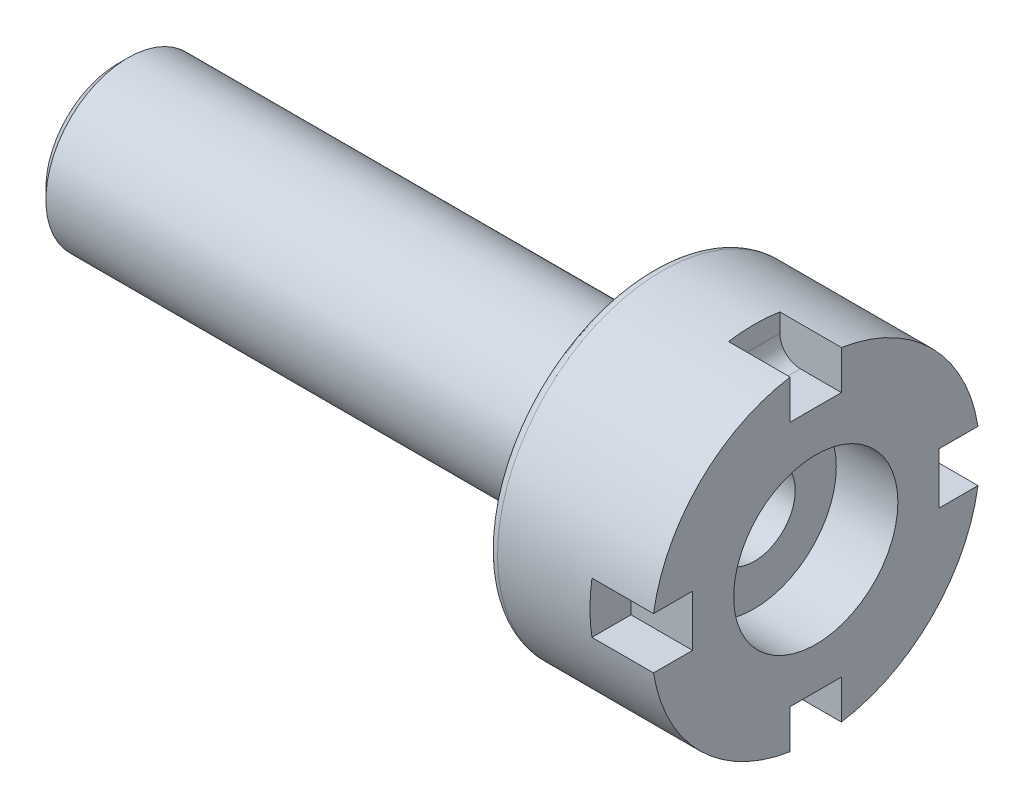
ISO-10303-21;
HEADER;
FILE_DESCRIPTION(('STEP AP214'),'2;1');
FILE_NAME('part.step','',(''),(''),'','','');
FILE_SCHEMA(('AUTOMOTIVE_DESIGN { 1 0 10303 214 1 1 1 1 }'));
ENDSEC;
DATA;
#1=APPLICATION_CONTEXT('core data for automotive mechanical design processes');
#2=APPLICATION_PROTOCOL_DEFINITION('international standard','automotive_design',2000,#1);
#3=PRODUCT_CONTEXT('',#1,'mechanical');
#4=PRODUCT('Part','Part','',(#3));
#5=PRODUCT_RELATED_PRODUCT_CATEGORY('part','',(#4));
#6=PRODUCT_DEFINITION_FORMATION('','',#4);
#7=PRODUCT_DEFINITION_CONTEXT('part definition',#1,'design');
#8=PRODUCT_DEFINITION('design','',#6,#7);
#9=PRODUCT_DEFINITION_SHAPE('','',#8);
#10=(LENGTH_UNIT() NAMED_UNIT(*) SI_UNIT(.MILLI.,.METRE.));
#11=(NAMED_UNIT(*) PLANE_ANGLE_UNIT() SI_UNIT($,.RADIAN.));
#12=(NAMED_UNIT(*) SI_UNIT($,.STERADIAN.) SOLID_ANGLE_UNIT());
#13=UNCERTAINTY_MEASURE_WITH_UNIT(LENGTH_MEASURE(1.E-05),#10,'distance_accuracy_value','');
#14=(GEOMETRIC_REPRESENTATION_CONTEXT(3) GLOBAL_UNCERTAINTY_ASSIGNED_CONTEXT((#13)) GLOBAL_UNIT_ASSIGNED_CONTEXT((#10,
#11,#12)) REPRESENTATION_CONTEXT('',''));
#15=CARTESIAN_POINT('',(0.,0.,0.));
#16=DIRECTION('',(0.,0.,1.));
#17=DIRECTION('',(1.,0.,0.));
#18=AXIS2_PLACEMENT_3D('',#15,#16,#17);
#19=CARTESIAN_POINT('',(-88.99,0.,0.));
#20=DIRECTION('',(-1.,0.,0.));
#21=DIRECTION('',(0.,0.,1.));
#22=AXIS2_PLACEMENT_3D('',#19,#20,#21);
#23=CYLINDRICAL_SURFACE('',#22,20.);
#24=CARTESIAN_POINT('',(-288.48571603173,0.,0.));
#25=DIRECTION('',(1.,0.,0.));
#26=DIRECTION('',(0.,0.,-1.));
#27=AXIS2_PLACEMENT_3D('',#24,#25,#26);
#28=CIRCLE('',#27,20.);
#29=CARTESIAN_POINT('',(-288.48571603173,0.,-20.));
#30=VERTEX_POINT('',#29);
#31=EDGE_CURVE('E11',#30,#30,#28,.F.);
#32=ORIENTED_EDGE('',*,*,#31,.T.);
#33=EDGE_LOOP('',(#32));
#34=FACE_BOUND('',#33,.T.);
#35=CARTESIAN_POINT('',(16.5142839682696,0.,0.));
#36=DIRECTION('',(1.,0.,0.));
#37=DIRECTION('',(0.,0.,-1.));
#38=AXIS2_PLACEMENT_3D('',#35,#36,#37);
#39=CIRCLE('',#38,20.);
#40=CARTESIAN_POINT('',(16.5142839682696,0.,-20.));
#41=VERTEX_POINT('',#40);
#42=EDGE_CURVE('E264',#41,#41,#39,.F.);
#43=ORIENTED_EDGE('',*,*,#42,.F.);
#44=EDGE_LOOP('',(#43));
#45=FACE_BOUND('',#44,.T.);
#46=ADVANCED_FACE('F47',(#34,#45),#23,.F.);
#47=CARTESIAN_POINT('',(-293.48571603173,40.,0.));
#48=DIRECTION('',(1.,0.,0.));
#49=DIRECTION('',(0.,0.,-1.));
#50=AXIS2_PLACEMENT_3D('',#47,#48,#49);
#51=PLANE('',#50);
#52=CARTESIAN_POINT('',(-293.48571603173,0.,0.));
#53=DIRECTION('',(1.,0.,0.));
#54=DIRECTION('',(0.,0.,-1.));
#55=AXIS2_PLACEMENT_3D('',#52,#53,#54);
#56=CIRCLE('',#55,34.9999999999999);
#57=CARTESIAN_POINT('',(-293.48571603173,0.,-34.9999999999999));
#58=VERTEX_POINT('',#57);
#59=EDGE_CURVE('E376',#58,#58,#56,.F.);
#60=ORIENTED_EDGE('',*,*,#59,.T.);
#61=EDGE_LOOP('',(#60));
#62=FACE_BOUND('',#61,.T.);
#63=CARTESIAN_POINT('',(-293.48571603173,0.,0.));
#64=DIRECTION('',(1.,0.,0.));
#65=DIRECTION('',(0.,0.,-1.));
#66=AXIS2_PLACEMENT_3D('',#63,#64,#65);
#67=CIRCLE('',#66,25.);
#68=CARTESIAN_POINT('',(-293.48571603173,0.,-25.));
#69=VERTEX_POINT('',#68);
#70=EDGE_CURVE('E372',#69,#69,#67,.T.);
#71=ORIENTED_EDGE('',*,*,#70,.T.);
#72=EDGE_LOOP('',(#71));
#73=FACE_BOUND('',#72,.T.);
#74=ADVANCED_FACE('F392',(#62,#73),#51,.F.);
#75=CARTESIAN_POINT('',(46.5142839682696,80.,0.));
#76=DIRECTION('',(-1.,0.,0.));
#77=DIRECTION('',(0.,0.,1.));
#78=AXIS2_PLACEMENT_3D('',#75,#76,#77);
#79=PLANE('',#78);
#80=CARTESIAN_POINT('',(46.5142839682696,0.,0.));
#81=DIRECTION('',(1.,0.,0.));
#82=DIRECTION('',(0.,0.,-1.));
#83=AXIS2_PLACEMENT_3D('',#80,#81,#82);
#84=CIRCLE('',#83,40.);
#85=CARTESIAN_POINT('',(46.5142839682696,0.,-40.));
#86=VERTEX_POINT('',#85);
#87=EDGE_CURVE('E265',#86,#86,#84,.T.);
#88=ORIENTED_EDGE('',*,*,#87,.F.);
#89=EDGE_LOOP('',(#88));
#90=FACE_BOUND('',#89,.T.);
#91=CARTESIAN_POINT('',(46.5142839682696,0.,0.));
#92=DIRECTION('',(-1.,0.,0.));
#93=DIRECTION('',(0.,0.,1.));
#94=AXIS2_PLACEMENT_3D('',#91,#92,#93);
#95=CIRCLE('',#94,80.);
#96=CARTESIAN_POINT('',(46.5142839682696,-12.4999999999992,-79.0174031463957));
#97=VERTEX_POINT('',#96);
#98=CARTESIAN_POINT('',(46.5142839682696,-79.0174031463955,-12.5));
#99=VERTEX_POINT('',#98);
#100=EDGE_CURVE('E297',#97,#99,#95,.T.);
#101=ORIENTED_EDGE('',*,*,#100,.F.);
#102=DIRECTION('',(0.,0.,-1.));
#103=VECTOR('',#102,1.);
#104=CARTESIAN_POINT('',(46.5142839682696,-12.4999999999991,-90.0000000000001));
#105=LINE('',#104,#103);
#106=CARTESIAN_POINT('',(46.5142839682696,-12.4999999999994,-60.0000000000001));
#107=VERTEX_POINT('',#106);
#108=EDGE_CURVE('E246',#107,#97,#105,.T.);
#109=ORIENTED_EDGE('',*,*,#108,.F.);
#110=DIRECTION('',(0.,-1.,0.));
#111=VECTOR('',#110,1.);
#112=CARTESIAN_POINT('',(46.5142839682696,12.5000000000006,-59.9999999999999));
#113=LINE('',#112,#111);
#114=CARTESIAN_POINT('',(46.5142839682696,12.5000000000006,-59.9999999999999));
#115=VERTEX_POINT('',#114);
#116=EDGE_CURVE('E239',#115,#107,#113,.T.);
#117=ORIENTED_EDGE('',*,*,#116,.F.);
#118=DIRECTION('',(0.,0.,1.));
#119=VECTOR('',#118,1.);
#120=CARTESIAN_POINT('',(46.5142839682696,12.5000000000009,-89.9999999999999));
#121=LINE('',#120,#119);
#122=CARTESIAN_POINT('',(46.5142839682696,12.5000000000008,-79.0174031463954));
#123=VERTEX_POINT('',#122);
#124=EDGE_CURVE('E249',#123,#115,#121,.T.);
#125=ORIENTED_EDGE('',*,*,#124,.F.);
#126=CARTESIAN_POINT('',(46.5142839682696,79.0174031463955,-12.5));
#127=VERTEX_POINT('',#126);
#128=EDGE_CURVE('E292',#127,#123,#95,.T.);
#129=ORIENTED_EDGE('',*,*,#128,.F.);
#130=DIRECTION('',(0.,1.,0.));
#131=VECTOR('',#130,1.);
#132=CARTESIAN_POINT('',(46.5142839682696,90.,-12.5));
#133=LINE('',#132,#131);
#134=CARTESIAN_POINT('',(46.5142839682696,60.,-12.5));
#135=VERTEX_POINT('',#134);
#136=EDGE_CURVE('E269',#135,#127,#133,.T.);
#137=ORIENTED_EDGE('',*,*,#136,.F.);
#138=DIRECTION('',(0.,0.,-1.));
#139=VECTOR('',#138,1.);
#140=CARTESIAN_POINT('',(46.5142839682696,60.,12.5));
#141=LINE('',#140,#139);
#142=CARTESIAN_POINT('',(46.5142839682696,60.,12.5));
#143=VERTEX_POINT('',#142);
#144=EDGE_CURVE('E276',#143,#135,#141,.T.);
#145=ORIENTED_EDGE('',*,*,#144,.F.);
#146=DIRECTION('',(0.,-1.,0.));
#147=VECTOR('',#146,1.);
#148=CARTESIAN_POINT('',(46.5142839682696,90.,12.5));
#149=LINE('',#148,#147);
#150=CARTESIAN_POINT('',(46.5142839682696,79.0174031463955,12.5));
#151=VERTEX_POINT('',#150);
#152=EDGE_CURVE('E280',#151,#143,#149,.T.);
#153=ORIENTED_EDGE('',*,*,#152,.F.);
#154=CARTESIAN_POINT('',(46.5142839682696,12.4999999999997,79.0174031463956));
#155=VERTEX_POINT('',#154);
#156=EDGE_CURVE('E298',#155,#151,#95,.T.);
#157=ORIENTED_EDGE('',*,*,#156,.F.);
#158=DIRECTION('',(0.,0.,1.));
#159=VECTOR('',#158,1.);
#160=CARTESIAN_POINT('',(46.5142839682696,12.4999999999997,90.));
#161=LINE('',#160,#159);
#162=CARTESIAN_POINT('',(46.5142839682696,12.4999999999998,60.));
#163=VERTEX_POINT('',#162);
#164=EDGE_CURVE('E209',#163,#155,#161,.T.);
#165=ORIENTED_EDGE('',*,*,#164,.F.);
#166=DIRECTION('',(0.,1.,0.));
#167=VECTOR('',#166,1.);
#168=CARTESIAN_POINT('',(46.5142839682696,-12.5000000000002,60.));
#169=LINE('',#168,#167);
#170=CARTESIAN_POINT('',(46.5142839682696,-12.5000000000002,60.));
#171=VERTEX_POINT('',#170);
#172=EDGE_CURVE('E214',#171,#163,#169,.T.);
#173=ORIENTED_EDGE('',*,*,#172,.F.);
#174=DIRECTION('',(0.,0.,-1.));
#175=VECTOR('',#174,1.);
#176=CARTESIAN_POINT('',(46.5142839682696,-12.5000000000003,90.));
#177=LINE('',#176,#175);
#178=CARTESIAN_POINT('',(46.5142839682696,-12.5000000000003,79.0174031463955));
#179=VERTEX_POINT('',#178);
#180=EDGE_CURVE('E223',#179,#171,#177,.T.);
#181=ORIENTED_EDGE('',*,*,#180,.F.);
#182=CARTESIAN_POINT('',(46.5142839682696,-79.0174031463955,12.5));
#183=VERTEX_POINT('',#182);
#184=EDGE_CURVE('E749',#183,#179,#95,.T.);
#185=ORIENTED_EDGE('',*,*,#184,.F.);
#186=DIRECTION('',(0.,-1.,0.));
#187=VECTOR('',#186,1.);
#188=CARTESIAN_POINT('',(46.5142839682696,-90.,12.5));
#189=LINE('',#188,#187);
#190=CARTESIAN_POINT('',(46.5142839682696,-60.,12.5));
#191=VERTEX_POINT('',#190);
#192=EDGE_CURVE('E199',#191,#183,#189,.T.);
#193=ORIENTED_EDGE('',*,*,#192,.F.);
#194=DIRECTION('',(0.,0.,1.));
#195=VECTOR('',#194,1.);
#196=CARTESIAN_POINT('',(46.5142839682696,-60.,-12.5));
#197=LINE('',#196,#195);
#198=CARTESIAN_POINT('',(46.5142839682696,-60.,-12.5));
#199=VERTEX_POINT('',#198);
#200=EDGE_CURVE('E205',#199,#191,#197,.T.);
#201=ORIENTED_EDGE('',*,*,#200,.F.);
#202=DIRECTION('',(0.,1.,0.));
#203=VECTOR('',#202,1.);
#204=CARTESIAN_POINT('',(46.5142839682696,-90.,-12.5));
#205=LINE('',#204,#203);
#206=EDGE_CURVE('E186',#99,#199,#205,.T.);
#207=ORIENTED_EDGE('',*,*,#206,.F.);
#208=EDGE_LOOP('',(#101,#109,#117,#125,#129,#137,#145,#153,#157,#165,#173,#181,#185,#193,#201,#207));
#209=FACE_BOUND('',#208,.T.);
#210=ADVANCED_FACE('F395',(#90,#209),#79,.F.);
#211=CARTESIAN_POINT('',(-88.99,0.,0.));
#212=DIRECTION('',(-1.,0.,0.));
#213=DIRECTION('',(0.,0.,1.));
#214=AXIS2_PLACEMENT_3D('',#211,#212,#213);
#215=CYLINDRICAL_SURFACE('',#214,80.);
#216=CARTESIAN_POINT('',(-28.4857160317304,0.,0.));
#217=DIRECTION('',(1.,0.,0.));
#218=DIRECTION('',(0.,0.,-1.));
#219=AXIS2_PLACEMENT_3D('',#216,#217,#218);
#220=CIRCLE('',#219,80.);
#221=CARTESIAN_POINT('',(-28.4857160317304,0.,-80.));
#222=VERTEX_POINT('',#221);
#223=EDGE_CURVE('E364',#222,#222,#220,.T.);
#224=ORIENTED_EDGE('',*,*,#223,.T.);
#225=EDGE_LOOP('',(#224));
#226=FACE_BOUND('',#225,.T.);
#227=CARTESIAN_POINT('',(16.5142839682696,0.,0.));
#228=DIRECTION('',(1.,0.,0.));
#229=DIRECTION('',(0.,0.,-1.));
#230=AXIS2_PLACEMENT_3D('',#227,#228,#229);
#231=CIRCLE('',#230,80.);
#232=CARTESIAN_POINT('',(16.5142839682696,-12.4999999999992,-79.0174031463957));
#233=VERTEX_POINT('',#232);
#234=CARTESIAN_POINT('',(16.5142839682696,12.5000000000008,-79.0174031463954));
#235=VERTEX_POINT('',#234);
#236=EDGE_CURVE('E345',#233,#235,#231,.T.);
#237=ORIENTED_EDGE('',*,*,#236,.F.);
#238=DIRECTION('',(-1.,0.,0.));
#239=VECTOR('',#238,1.);
#240=CARTESIAN_POINT('',(-88.99,-12.4999999999992,-79.0174031463957));
#241=LINE('',#240,#239);
#242=EDGE_CURVE('E352',#233,#97,#241,.F.);
#243=ORIENTED_EDGE('',*,*,#242,.T.);
#244=ORIENTED_EDGE('',*,*,#100,.T.);
#245=DIRECTION('',(-1.,0.,0.));
#246=VECTOR('',#245,1.);
#247=CARTESIAN_POINT('',(-88.99,-79.0174031463955,-12.5));
#248=LINE('',#247,#246);
#249=CARTESIAN_POINT('',(16.5142839682696,-79.0174031463955,-12.5));
#250=VERTEX_POINT('',#249);
#251=EDGE_CURVE('E327',#99,#250,#248,.T.);
#252=ORIENTED_EDGE('',*,*,#251,.T.);
#253=CARTESIAN_POINT('',(16.5142839682696,0.,0.));
#254=DIRECTION('',(1.,0.,0.));
#255=DIRECTION('',(0.,0.,-1.));
#256=AXIS2_PLACEMENT_3D('',#253,#254,#255);
#257=CIRCLE('',#256,80.);
#258=CARTESIAN_POINT('',(16.5142839682696,-79.0174031463955,12.5));
#259=VERTEX_POINT('',#258);
#260=EDGE_CURVE('E176',#259,#250,#257,.T.);
#261=ORIENTED_EDGE('',*,*,#260,.F.);
#262=DIRECTION('',(-1.,0.,0.));
#263=VECTOR('',#262,1.);
#264=CARTESIAN_POINT('',(-88.99,-79.0174031463955,12.5));
#265=LINE('',#264,#263);
#266=EDGE_CURVE('E330',#259,#183,#265,.F.);
#267=ORIENTED_EDGE('',*,*,#266,.T.);
#268=ORIENTED_EDGE('',*,*,#184,.T.);
#269=DIRECTION('',(-1.,0.,0.));
#270=VECTOR('',#269,1.);
#271=CARTESIAN_POINT('',(-88.99,-12.5000000000003,79.0174031463955));
#272=LINE('',#271,#270);
#273=CARTESIAN_POINT('',(16.5142839682696,-12.5000000000003,79.0174031463955));
#274=VERTEX_POINT('',#273);
#275=EDGE_CURVE('E337',#179,#274,#272,.T.);
#276=ORIENTED_EDGE('',*,*,#275,.T.);
#277=CARTESIAN_POINT('',(16.5142839682696,0.,0.));
#278=DIRECTION('',(1.,0.,0.));
#279=DIRECTION('',(0.,0.,-1.));
#280=AXIS2_PLACEMENT_3D('',#277,#278,#279);
#281=CIRCLE('',#280,80.);
#282=CARTESIAN_POINT('',(16.5142839682696,12.4999999999997,79.0174031463956));
#283=VERTEX_POINT('',#282);
#284=EDGE_CURVE('E334',#283,#274,#281,.T.);
#285=ORIENTED_EDGE('',*,*,#284,.F.);
#286=DIRECTION('',(-1.,0.,0.));
#287=VECTOR('',#286,1.);
#288=CARTESIAN_POINT('',(-88.99,12.4999999999997,79.0174031463956));
#289=LINE('',#288,#287);
#290=EDGE_CURVE('E341',#283,#155,#289,.F.);
#291=ORIENTED_EDGE('',*,*,#290,.T.);
#292=ORIENTED_EDGE('',*,*,#156,.T.);
#293=DIRECTION('',(-1.,0.,0.));
#294=VECTOR('',#293,1.);
#295=CARTESIAN_POINT('',(-88.99,79.0174031463955,12.5));
#296=LINE('',#295,#294);
#297=CARTESIAN_POINT('',(16.5142839682696,79.0174031463955,12.5));
#298=VERTEX_POINT('',#297);
#299=EDGE_CURVE('E301',#151,#298,#296,.T.);
#300=ORIENTED_EDGE('',*,*,#299,.T.);
#301=CARTESIAN_POINT('',(16.5142839682696,0.,0.));
#302=DIRECTION('',(1.,0.,0.));
#303=DIRECTION('',(0.,0.,-1.));
#304=AXIS2_PLACEMENT_3D('',#301,#302,#303);
#305=CIRCLE('',#304,80.);
#306=CARTESIAN_POINT('',(16.5142839682696,79.0174031463955,-12.5));
#307=VERTEX_POINT('',#306);
#308=EDGE_CURVE('E296',#307,#298,#305,.T.);
#309=ORIENTED_EDGE('',*,*,#308,.F.);
#310=DIRECTION('',(-1.,0.,0.));
#311=VECTOR('',#310,1.);
#312=CARTESIAN_POINT('',(-88.99,79.0174031463955,-12.5));
#313=LINE('',#312,#311);
#314=EDGE_CURVE('E305',#307,#127,#313,.F.);
#315=ORIENTED_EDGE('',*,*,#314,.T.);
#316=ORIENTED_EDGE('',*,*,#128,.T.);
#317=DIRECTION('',(-1.,0.,0.));
#318=VECTOR('',#317,1.);
#319=CARTESIAN_POINT('',(-88.99,12.5000000000008,-79.0174031463954));
#320=LINE('',#319,#318);
#321=EDGE_CURVE('E348',#123,#235,#320,.T.);
#322=ORIENTED_EDGE('',*,*,#321,.T.);
#323=EDGE_LOOP('',(#237,#243,#244,#252,#261,#267,#268,#276,#285,#291,#292,#300,#309,#315,#316,#322));
#324=FACE_BOUND('',#323,.T.);
#325=ADVANCED_FACE('F444',(#226,#324),#215,.T.);
#326=CARTESIAN_POINT('',(-33.4857160317304,80.,0.));
#327=DIRECTION('',(1.,0.,0.));
#328=DIRECTION('',(0.,0.,-1.));
#329=AXIS2_PLACEMENT_3D('',#326,#327,#328);
#330=PLANE('',#329);
#331=CARTESIAN_POINT('',(-33.4857160317304,0.,0.));
#332=DIRECTION('',(1.,0.,0.));
#333=DIRECTION('',(0.,0.,-1.));
#334=AXIS2_PLACEMENT_3D('',#331,#332,#333);
#335=CIRCLE('',#334,75.);
#336=CARTESIAN_POINT('',(-33.4857160317304,0.,-75.));
#337=VERTEX_POINT('',#336);
#338=EDGE_CURVE('E360',#337,#337,#335,.F.);
#339=ORIENTED_EDGE('',*,*,#338,.T.);
#340=EDGE_LOOP('',(#339));
#341=FACE_BOUND('',#340,.T.);
#342=CARTESIAN_POINT('',(-33.4857160317304,0.,0.));
#343=DIRECTION('',(1.,0.,0.));
#344=DIRECTION('',(0.,0.,-1.));
#345=AXIS2_PLACEMENT_3D('',#342,#343,#344);
#346=CIRCLE('',#345,45.);
#347=CARTESIAN_POINT('',(-33.4857160317304,0.,-45.));
#348=VERTEX_POINT('',#347);
#349=EDGE_CURVE('E356',#348,#348,#346,.T.);
#350=ORIENTED_EDGE('',*,*,#349,.T.);
#351=EDGE_LOOP('',(#350));
#352=FACE_BOUND('',#351,.T.);
#353=ADVANCED_FACE('F441',(#341,#352),#330,.F.);
#354=CARTESIAN_POINT('',(-88.99,0.,0.));
#355=DIRECTION('',(-1.,0.,0.));
#356=DIRECTION('',(0.,0.,1.));
#357=AXIS2_PLACEMENT_3D('',#354,#355,#356);
#358=CYLINDRICAL_SURFACE('',#357,40.);
#359=CARTESIAN_POINT('',(-288.48571603173,0.,0.));
#360=DIRECTION('',(1.,0.,0.));
#361=DIRECTION('',(0.,0.,-1.));
#362=AXIS2_PLACEMENT_3D('',#359,#360,#361);
#363=CIRCLE('',#362,40.);
#364=CARTESIAN_POINT('',(-288.48571603173,0.,-40.));
#365=VERTEX_POINT('',#364);
#366=EDGE_CURVE('E57',#365,#365,#363,.T.);
#367=ORIENTED_EDGE('',*,*,#366,.T.);
#368=EDGE_LOOP('',(#367));
#369=FACE_BOUND('',#368,.T.);
#370=CARTESIAN_POINT('',(-38.4857160317304,0.,0.));
#371=DIRECTION('',(1.,0.,0.));
#372=DIRECTION('',(0.,0.,-1.));
#373=AXIS2_PLACEMENT_3D('',#370,#371,#372);
#374=CIRCLE('',#373,40.);
#375=CARTESIAN_POINT('',(-38.4857160317304,0.,-40.));
#376=VERTEX_POINT('',#375);
#377=EDGE_CURVE('E368',#376,#376,#374,.F.);
#378=ORIENTED_EDGE('',*,*,#377,.T.);
#379=EDGE_LOOP('',(#378));
#380=FACE_BOUND('',#379,.T.);
#381=ADVANCED_FACE('F383',(#369,#380),#358,.T.);
#382=CARTESIAN_POINT('',(16.5142839682696,90.,-12.5));
#383=DIRECTION('',(0.,0.,-1.));
#384=DIRECTION('',(-1.,0.,0.));
#385=AXIS2_PLACEMENT_3D('',#382,#383,#384);
#386=PLANE('',#385);
#387=DIRECTION('',(0.,1.,0.));
#388=VECTOR('',#387,1.);
#389=CARTESIAN_POINT('',(16.5142839682696,90.,-12.5));
#390=LINE('',#389,#388);
#391=CARTESIAN_POINT('',(16.5142839682696,70.,-12.5));
#392=VERTEX_POINT('',#391);
#393=EDGE_CURVE('E281',#392,#307,#390,.T.);
#394=ORIENTED_EDGE('',*,*,#393,.F.);
#395=CARTESIAN_POINT('',(26.5142839682696,70.,-12.5));
#396=DIRECTION('',(0.,0.,-1.));
#397=DIRECTION('',(-1.,0.,0.));
#398=AXIS2_PLACEMENT_3D('',#395,#396,#397);
#399=CIRCLE('',#398,10.);
#400=CARTESIAN_POINT('',(26.5142839682696,60.,-12.5));
#401=VERTEX_POINT('',#400);
#402=EDGE_CURVE('E316',#392,#401,#399,.F.);
#403=ORIENTED_EDGE('',*,*,#402,.T.);
#404=DIRECTION('',(1.,0.,0.));
#405=VECTOR('',#404,1.);
#406=CARTESIAN_POINT('',(16.5142839682696,60.,-12.5));
#407=LINE('',#406,#405);
#408=EDGE_CURVE('E232',#401,#135,#407,.T.);
#409=ORIENTED_EDGE('',*,*,#408,.T.);
#410=ORIENTED_EDGE('',*,*,#136,.T.);
#411=ORIENTED_EDGE('',*,*,#314,.F.);
#412=EDGE_LOOP('',(#394,#403,#409,#410,#411));
#413=FACE_BOUND('',#412,.T.);
#414=ADVANCED_FACE('F428',(#413),#386,.F.);
#415=CARTESIAN_POINT('',(16.5142839682696,90.,12.5));
#416=DIRECTION('',(0.,0.,1.));
#417=DIRECTION('',(0.,-1.,0.));
#418=AXIS2_PLACEMENT_3D('',#415,#416,#417);
#419=PLANE('',#418);
#420=DIRECTION('',(1.,0.,0.));
#421=VECTOR('',#420,1.);
#422=CARTESIAN_POINT('',(16.5142839682696,60.,12.5));
#423=LINE('',#422,#421);
#424=CARTESIAN_POINT('',(26.5142839682696,60.,12.5));
#425=VERTEX_POINT('',#424);
#426=EDGE_CURVE('E270',#425,#143,#423,.T.);
#427=ORIENTED_EDGE('',*,*,#426,.F.);
#428=CARTESIAN_POINT('',(26.5142839682696,70.,12.5));
#429=DIRECTION('',(0.,0.,1.));
#430=DIRECTION('',(0.,-1.,0.));
#431=AXIS2_PLACEMENT_3D('',#428,#429,#430);
#432=CIRCLE('',#431,10.);
#433=CARTESIAN_POINT('',(16.5142839682696,70.,12.5));
#434=VERTEX_POINT('',#433);
#435=EDGE_CURVE('E322',#425,#434,#432,.F.);
#436=ORIENTED_EDGE('',*,*,#435,.T.);
#437=DIRECTION('',(0.,-1.,0.));
#438=VECTOR('',#437,1.);
#439=CARTESIAN_POINT('',(16.5142839682696,90.,12.5));
#440=LINE('',#439,#438);
#441=EDGE_CURVE('E273',#298,#434,#440,.T.);
#442=ORIENTED_EDGE('',*,*,#441,.F.);
#443=ORIENTED_EDGE('',*,*,#299,.F.);
#444=ORIENTED_EDGE('',*,*,#152,.T.);
#445=EDGE_LOOP('',(#427,#436,#442,#443,#444));
#446=FACE_BOUND('',#445,.T.);
#447=ADVANCED_FACE('F431',(#446),#419,.F.);
#448=CARTESIAN_POINT('',(16.5142839682696,0.,0.));
#449=DIRECTION('',(1.,0.,0.));
#450=DIRECTION('',(0.,0.,-1.));
#451=AXIS2_PLACEMENT_3D('',#448,#449,#450);
#452=PLANE('',#451);
#453=ORIENTED_EDGE('',*,*,#441,.T.);
#454=DIRECTION('',(0.,0.,-1.));
#455=VECTOR('',#454,1.);
#456=CARTESIAN_POINT('',(16.5142839682696,70.,0.));
#457=LINE('',#456,#455);
#458=EDGE_CURVE('E309',#434,#392,#457,.T.);
#459=ORIENTED_EDGE('',*,*,#458,.T.);
#460=ORIENTED_EDGE('',*,*,#393,.T.);
#461=ORIENTED_EDGE('',*,*,#308,.T.);
#462=EDGE_LOOP('',(#453,#459,#460,#461));
#463=FACE_BOUND('',#462,.T.);
#464=ADVANCED_FACE('F421',(#463),#452,.T.);
#465=CARTESIAN_POINT('',(16.5142839682696,60.,12.5));
#466=DIRECTION('',(0.,-1.,0.));
#467=DIRECTION('',(0.,0.,-1.));
#468=AXIS2_PLACEMENT_3D('',#465,#466,#467);
#469=PLANE('',#468);
#470=ORIENTED_EDGE('',*,*,#408,.F.);
#471=DIRECTION('',(0.,0.,-1.));
#472=VECTOR('',#471,1.);
#473=CARTESIAN_POINT('',(26.5142839682696,60.,12.5));
#474=LINE('',#473,#472);
#475=EDGE_CURVE('E319',#401,#425,#474,.F.);
#476=ORIENTED_EDGE('',*,*,#475,.T.);
#477=ORIENTED_EDGE('',*,*,#426,.T.);
#478=ORIENTED_EDGE('',*,*,#144,.T.);
#479=EDGE_LOOP('',(#470,#476,#477,#478));
#480=FACE_BOUND('',#479,.T.);
#481=ADVANCED_FACE('F411',(#480),#469,.F.);
#482=CARTESIAN_POINT('',(16.5142839682696,0.,0.));
#483=DIRECTION('',(1.,0.,0.));
#484=DIRECTION('',(0.,0.,-1.));
#485=AXIS2_PLACEMENT_3D('',#482,#483,#484);
#486=PLANE('',#485);
#487=CARTESIAN_POINT('',(16.5142839682696,0.,0.));
#488=DIRECTION('',(1.,0.,0.));
#489=DIRECTION('',(0.,0.,-1.));
#490=AXIS2_PLACEMENT_3D('',#487,#488,#489);
#491=CIRCLE('',#490,40.);
#492=CARTESIAN_POINT('',(16.5142839682696,0.,-40.));
#493=VERTEX_POINT('',#492);
#494=EDGE_CURVE('E260',#493,#493,#491,.T.);
#495=ORIENTED_EDGE('',*,*,#494,.T.);
#496=EDGE_LOOP('',(#495));
#497=FACE_BOUND('',#496,.T.);
#498=ORIENTED_EDGE('',*,*,#42,.T.);
#499=EDGE_LOOP('',(#498));
#500=FACE_BOUND('',#499,.T.);
#501=ADVANCED_FACE('F408',(#497,#500),#486,.T.);
#502=CARTESIAN_POINT('',(16.5142839682696,0.,0.));
#503=DIRECTION('',(1.,0.,0.));
#504=DIRECTION('',(0.,0.,-1.));
#505=AXIS2_PLACEMENT_3D('',#502,#503,#504);
#506=CYLINDRICAL_SURFACE('',#505,40.);
#507=ORIENTED_EDGE('',*,*,#494,.F.);
#508=EDGE_LOOP('',(#507));
#509=FACE_BOUND('',#508,.T.);
#510=ORIENTED_EDGE('',*,*,#87,.T.);
#511=EDGE_LOOP('',(#510));
#512=FACE_BOUND('',#511,.T.);
#513=ADVANCED_FACE('F410',(#509,#512),#506,.F.);
#514=CARTESIAN_POINT('',(26.5142839682696,70.,0.));
#515=DIRECTION('',(0.,0.,-1.));
#516=DIRECTION('',(0.,1.,0.));
#517=AXIS2_PLACEMENT_3D('',#514,#515,#516);
#518=CYLINDRICAL_SURFACE('',#517,10.);
#519=ORIENTED_EDGE('',*,*,#435,.F.);
#520=ORIENTED_EDGE('',*,*,#475,.F.);
#521=ORIENTED_EDGE('',*,*,#402,.F.);
#522=ORIENTED_EDGE('',*,*,#458,.F.);
#523=EDGE_LOOP('',(#519,#520,#521,#522));
#524=FACE_BOUND('',#523,.T.);
#525=ADVANCED_FACE('F418',(#524),#518,.F.);
#526=CARTESIAN_POINT('',(16.5142839682696,-90.,12.5));
#527=DIRECTION('',(0.,0.,1.));
#528=DIRECTION('',(1.,0.,0.));
#529=AXIS2_PLACEMENT_3D('',#526,#527,#528);
#530=PLANE('',#529);
#531=DIRECTION('',(0.,-1.,0.));
#532=VECTOR('',#531,1.);
#533=CARTESIAN_POINT('',(16.5142839682696,-90.,12.5));
#534=LINE('',#533,#532);
#535=CARTESIAN_POINT('',(16.5142839682696,-60.,12.5));
#536=VERTEX_POINT('',#535);
#537=EDGE_CURVE('E180',#536,#259,#534,.T.);
#538=ORIENTED_EDGE('',*,*,#537,.F.);
#539=DIRECTION('',(1.,0.,0.));
#540=VECTOR('',#539,1.);
#541=CARTESIAN_POINT('',(16.5142839682696,-60.,12.5));
#542=LINE('',#541,#540);
#543=EDGE_CURVE('E191',#536,#191,#542,.T.);
#544=ORIENTED_EDGE('',*,*,#543,.T.);
#545=ORIENTED_EDGE('',*,*,#192,.T.);
#546=ORIENTED_EDGE('',*,*,#266,.F.);
#547=EDGE_LOOP('',(#538,#544,#545,#546));
#548=FACE_BOUND('',#547,.T.);
#549=ADVANCED_FACE('F454',(#548),#530,.F.);
#550=CARTESIAN_POINT('',(16.5142839682696,-90.,-12.5));
#551=DIRECTION('',(0.,0.,-1.));
#552=DIRECTION('',(0.,1.,0.));
#553=AXIS2_PLACEMENT_3D('',#550,#551,#552);
#554=PLANE('',#553);
#555=ORIENTED_EDGE('',*,*,#206,.T.);
#556=DIRECTION('',(1.,0.,0.));
#557=VECTOR('',#556,1.);
#558=CARTESIAN_POINT('',(16.5142839682696,-60.,-12.5));
#559=LINE('',#558,#557);
#560=CARTESIAN_POINT('',(16.5142839682696,-60.,-12.5));
#561=VERTEX_POINT('',#560);
#562=EDGE_CURVE('E183',#561,#199,#559,.T.);
#563=ORIENTED_EDGE('',*,*,#562,.F.);
#564=DIRECTION('',(0.,1.,0.));
#565=VECTOR('',#564,1.);
#566=CARTESIAN_POINT('',(16.5142839682696,-90.,-12.5));
#567=LINE('',#566,#565);
#568=EDGE_CURVE('E170',#250,#561,#567,.T.);
#569=ORIENTED_EDGE('',*,*,#568,.F.);
#570=ORIENTED_EDGE('',*,*,#251,.F.);
#571=EDGE_LOOP('',(#555,#563,#569,#570));
#572=FACE_BOUND('',#571,.T.);
#573=ADVANCED_FACE('F184',(#572),#554,.F.);
#574=CARTESIAN_POINT('',(16.5142839682696,0.,0.));
#575=DIRECTION('',(1.,0.,0.));
#576=DIRECTION('',(0.,0.,1.));
#577=AXIS2_PLACEMENT_3D('',#574,#575,#576);
#578=PLANE('',#577);
#579=ORIENTED_EDGE('',*,*,#260,.T.);
#580=ORIENTED_EDGE('',*,*,#568,.T.);
#581=DIRECTION('',(0.,0.,1.));
#582=VECTOR('',#581,1.);
#583=CARTESIAN_POINT('',(16.5142839682696,-60.,-12.5));
#584=LINE('',#583,#582);
#585=EDGE_CURVE('E174',#561,#536,#584,.T.);
#586=ORIENTED_EDGE('',*,*,#585,.T.);
#587=ORIENTED_EDGE('',*,*,#537,.T.);
#588=EDGE_LOOP('',(#579,#580,#586,#587));
#589=FACE_BOUND('',#588,.T.);
#590=ADVANCED_FACE('F172',(#589),#578,.T.);
#591=CARTESIAN_POINT('',(16.5142839682696,-60.,-12.5));
#592=DIRECTION('',(0.,1.,0.));
#593=DIRECTION('',(0.,0.,1.));
#594=AXIS2_PLACEMENT_3D('',#591,#592,#593);
#595=PLANE('',#594);
#596=ORIENTED_EDGE('',*,*,#200,.T.);
#597=ORIENTED_EDGE('',*,*,#543,.F.);
#598=ORIENTED_EDGE('',*,*,#585,.F.);
#599=ORIENTED_EDGE('',*,*,#562,.T.);
#600=EDGE_LOOP('',(#596,#597,#598,#599));
#601=FACE_BOUND('',#600,.T.);
#602=ADVANCED_FACE('F193',(#601),#595,.F.);
#603=CARTESIAN_POINT('',(16.5142839682696,12.4999999999997,90.));
#604=DIRECTION('',(0.,1.,0.));
#605=DIRECTION('',(0.,0.,1.));
#606=AXIS2_PLACEMENT_3D('',#603,#604,#605);
#607=PLANE('',#606);
#608=DIRECTION('',(0.,0.,1.));
#609=VECTOR('',#608,1.);
#610=CARTESIAN_POINT('',(16.5142839682696,12.4999999999997,90.));
#611=LINE('',#610,#609);
#612=CARTESIAN_POINT('',(16.5142839682696,12.4999999999998,60.));
#613=VERTEX_POINT('',#612);
#614=EDGE_CURVE('E72',#613,#283,#611,.T.);
#615=ORIENTED_EDGE('',*,*,#614,.F.);
#616=DIRECTION('',(1.,0.,0.));
#617=VECTOR('',#616,1.);
#618=CARTESIAN_POINT('',(16.5142839682696,12.4999999999998,60.));
#619=LINE('',#618,#617);
#620=EDGE_CURVE('E229',#613,#163,#619,.T.);
#621=ORIENTED_EDGE('',*,*,#620,.T.);
#622=ORIENTED_EDGE('',*,*,#164,.T.);
#623=ORIENTED_EDGE('',*,*,#290,.F.);
#624=EDGE_LOOP('',(#615,#621,#622,#623));
#625=FACE_BOUND('',#624,.T.);
#626=ADVANCED_FACE('F576',(#625),#607,.F.);
#627=CARTESIAN_POINT('',(16.5142839682696,-12.5000000000003,90.));
#628=DIRECTION('',(0.,-1.,0.));
#629=DIRECTION('',(0.,0.,-1.));
#630=AXIS2_PLACEMENT_3D('',#627,#628,#629);
#631=PLANE('',#630);
#632=ORIENTED_EDGE('',*,*,#180,.T.);
#633=DIRECTION('',(1.,0.,0.));
#634=VECTOR('',#633,1.);
#635=CARTESIAN_POINT('',(16.5142839682696,-12.5000000000002,60.));
#636=LINE('',#635,#634);
#637=CARTESIAN_POINT('',(16.5142839682696,-12.5000000000002,60.));
#638=VERTEX_POINT('',#637);
#639=EDGE_CURVE('E220',#638,#171,#636,.T.);
#640=ORIENTED_EDGE('',*,*,#639,.F.);
#641=DIRECTION('',(0.,0.,-1.));
#642=VECTOR('',#641,1.);
#643=CARTESIAN_POINT('',(16.5142839682696,-12.5000000000003,90.));
#644=LINE('',#643,#642);
#645=EDGE_CURVE('E213',#274,#638,#644,.T.);
#646=ORIENTED_EDGE('',*,*,#645,.F.);
#647=ORIENTED_EDGE('',*,*,#275,.F.);
#648=EDGE_LOOP('',(#632,#640,#646,#647));
#649=FACE_BOUND('',#648,.T.);
#650=ADVANCED_FACE('F566',(#649),#631,.F.);
#651=CARTESIAN_POINT('',(16.5142839682696,0.,0.));
#652=DIRECTION('',(1.,0.,0.));
#653=DIRECTION('',(0.,1.,0.));
#654=AXIS2_PLACEMENT_3D('',#651,#652,#653);
#655=PLANE('',#654);
#656=ORIENTED_EDGE('',*,*,#284,.T.);
#657=ORIENTED_EDGE('',*,*,#645,.T.);
#658=DIRECTION('',(0.,1.,0.));
#659=VECTOR('',#658,1.);
#660=CARTESIAN_POINT('',(16.5142839682696,-12.5000000000002,60.));
#661=LINE('',#660,#659);
#662=EDGE_CURVE('E217',#638,#613,#661,.T.);
#663=ORIENTED_EDGE('',*,*,#662,.T.);
#664=ORIENTED_EDGE('',*,*,#614,.T.);
#665=EDGE_LOOP('',(#656,#657,#663,#664));
#666=FACE_BOUND('',#665,.T.);
#667=ADVANCED_FACE('F555',(#666),#655,.T.);
#668=CARTESIAN_POINT('',(16.5142839682696,-12.5000000000002,60.));
#669=DIRECTION('',(0.,0.,-1.));
#670=DIRECTION('',(0.,1.,0.));
#671=AXIS2_PLACEMENT_3D('',#668,#669,#670);
#672=PLANE('',#671);
#673=ORIENTED_EDGE('',*,*,#172,.T.);
#674=ORIENTED_EDGE('',*,*,#620,.F.);
#675=ORIENTED_EDGE('',*,*,#662,.F.);
#676=ORIENTED_EDGE('',*,*,#639,.T.);
#677=EDGE_LOOP('',(#673,#674,#675,#676));
#678=FACE_BOUND('',#677,.T.);
#679=ADVANCED_FACE('F545',(#678),#672,.F.);
#680=CARTESIAN_POINT('',(16.5142839682696,-12.4999999999991,-90.0000000000001));
#681=DIRECTION('',(0.,-1.,0.));
#682=DIRECTION('',(0.,0.,-1.));
#683=AXIS2_PLACEMENT_3D('',#680,#681,#682);
#684=PLANE('',#683);
#685=DIRECTION('',(0.,0.,-1.));
#686=VECTOR('',#685,1.);
#687=CARTESIAN_POINT('',(16.5142839682696,-12.4999999999991,-90.0000000000001));
#688=LINE('',#687,#686);
#689=CARTESIAN_POINT('',(16.5142839682696,-12.4999999999994,-60.0000000000001));
#690=VERTEX_POINT('',#689);
#691=EDGE_CURVE('E64',#690,#233,#688,.T.);
#692=ORIENTED_EDGE('',*,*,#691,.F.);
#693=DIRECTION('',(1.,0.,0.));
#694=VECTOR('',#693,1.);
#695=CARTESIAN_POINT('',(16.5142839682696,-12.4999999999994,-60.0000000000001));
#696=LINE('',#695,#694);
#697=EDGE_CURVE('E202',#690,#107,#696,.T.);
#698=ORIENTED_EDGE('',*,*,#697,.T.);
#699=ORIENTED_EDGE('',*,*,#108,.T.);
#700=ORIENTED_EDGE('',*,*,#242,.F.);
#701=EDGE_LOOP('',(#692,#698,#699,#700));
#702=FACE_BOUND('',#701,.T.);
#703=ADVANCED_FACE('F425',(#702),#684,.F.);
#704=CARTESIAN_POINT('',(16.5142839682696,12.5000000000009,-89.9999999999999));
#705=DIRECTION('',(0.,1.,0.));
#706=DIRECTION('',(0.,0.,1.));
#707=AXIS2_PLACEMENT_3D('',#704,#705,#706);
#708=PLANE('',#707);
#709=ORIENTED_EDGE('',*,*,#124,.T.);
#710=DIRECTION('',(1.,0.,0.));
#711=VECTOR('',#710,1.);
#712=CARTESIAN_POINT('',(16.5142839682696,12.5000000000006,-59.9999999999999));
#713=LINE('',#712,#711);
#714=CARTESIAN_POINT('',(16.5142839682696,12.5000000000006,-59.9999999999999));
#715=VERTEX_POINT('',#714);
#716=EDGE_CURVE('E245',#715,#115,#713,.T.);
#717=ORIENTED_EDGE('',*,*,#716,.F.);
#718=DIRECTION('',(0.,0.,1.));
#719=VECTOR('',#718,1.);
#720=CARTESIAN_POINT('',(16.5142839682696,12.5000000000009,-89.9999999999999));
#721=LINE('',#720,#719);
#722=EDGE_CURVE('E238',#235,#715,#721,.T.);
#723=ORIENTED_EDGE('',*,*,#722,.F.);
#724=ORIENTED_EDGE('',*,*,#321,.F.);
#725=EDGE_LOOP('',(#709,#717,#723,#724));
#726=FACE_BOUND('',#725,.T.);
#727=ADVANCED_FACE('F526',(#726),#708,.F.);
#728=CARTESIAN_POINT('',(16.5142839682696,0.,0.));
#729=DIRECTION('',(1.,0.,0.));
#730=DIRECTION('',(0.,-1.,0.));
#731=AXIS2_PLACEMENT_3D('',#728,#729,#730);
#732=PLANE('',#731);
#733=ORIENTED_EDGE('',*,*,#236,.T.);
#734=ORIENTED_EDGE('',*,*,#722,.T.);
#735=DIRECTION('',(0.,-1.,0.));
#736=VECTOR('',#735,1.);
#737=CARTESIAN_POINT('',(16.5142839682696,12.5000000000006,-59.9999999999999));
#738=LINE('',#737,#736);
#739=EDGE_CURVE('E242',#715,#690,#738,.T.);
#740=ORIENTED_EDGE('',*,*,#739,.T.);
#741=ORIENTED_EDGE('',*,*,#691,.T.);
#742=EDGE_LOOP('',(#733,#734,#740,#741));
#743=FACE_BOUND('',#742,.T.);
#744=ADVANCED_FACE('F514',(#743),#732,.T.);
#745=CARTESIAN_POINT('',(16.5142839682696,12.5000000000006,-59.9999999999999));
#746=DIRECTION('',(0.,0.,1.));
#747=DIRECTION('',(0.,-1.,0.));
#748=AXIS2_PLACEMENT_3D('',#745,#746,#747);
#749=PLANE('',#748);
#750=ORIENTED_EDGE('',*,*,#116,.T.);
#751=ORIENTED_EDGE('',*,*,#697,.F.);
#752=ORIENTED_EDGE('',*,*,#739,.F.);
#753=ORIENTED_EDGE('',*,*,#716,.T.);
#754=EDGE_LOOP('',(#750,#751,#752,#753));
#755=FACE_BOUND('',#754,.T.);
#756=ADVANCED_FACE('F459',(#755),#749,.F.);
#757=CARTESIAN_POINT('',(-28.4857160317304,0.,0.));
#758=DIRECTION('',(1.,0.,0.));
#759=DIRECTION('',(0.,0.,-1.));
#760=AXIS2_PLACEMENT_3D('',#757,#758,#759);
#761=TOROIDAL_SURFACE('',#760,75.,5.);
#762=ORIENTED_EDGE('',*,*,#223,.F.);
#763=EDGE_LOOP('',(#762));
#764=FACE_BOUND('',#763,.T.);
#765=ORIENTED_EDGE('',*,*,#338,.F.);
#766=EDGE_LOOP('',(#765));
#767=FACE_BOUND('',#766,.T.);
#768=ADVANCED_FACE('F456',(#764,#767),#761,.T.);
#769=CARTESIAN_POINT('',(-38.4857160317304,0.,0.));
#770=DIRECTION('',(1.,0.,0.));
#771=DIRECTION('',(0.,0.,-1.));
#772=AXIS2_PLACEMENT_3D('',#769,#770,#771);
#773=TOROIDAL_SURFACE('',#772,45.,5.);
#774=ORIENTED_EDGE('',*,*,#349,.F.);
#775=EDGE_LOOP('',(#774));
#776=FACE_BOUND('',#775,.T.);
#777=ORIENTED_EDGE('',*,*,#377,.F.);
#778=EDGE_LOOP('',(#777));
#779=FACE_BOUND('',#778,.T.);
#780=ADVANCED_FACE('F389',(#776,#779),#773,.F.);
#781=CARTESIAN_POINT('',(-293.48571603173,0.,0.));
#782=DIRECTION('',(1.,0.,0.));
#783=DIRECTION('',(0.,0.,-1.));
#784=AXIS2_PLACEMENT_3D('',#781,#782,#783);
#785=CONICAL_SURFACE('',#784,34.9999999999999,0.785398163397446);
#786=ORIENTED_EDGE('',*,*,#366,.F.);
#787=EDGE_LOOP('',(#786));
#788=FACE_BOUND('',#787,.T.);
#789=ORIENTED_EDGE('',*,*,#59,.F.);
#790=EDGE_LOOP('',(#789));
#791=FACE_BOUND('',#790,.T.);
#792=ADVANCED_FACE('F386',(#788,#791),#785,.T.);
#793=CARTESIAN_POINT('',(-288.48571603173,0.,0.));
#794=DIRECTION('',(-1.,0.,0.));
#795=DIRECTION('',(0.,0.,1.));
#796=AXIS2_PLACEMENT_3D('',#793,#794,#795);
#797=CONICAL_SURFACE('',#796,20.,0.785398163397444);
#798=ORIENTED_EDGE('',*,*,#70,.F.);
#799=EDGE_LOOP('',(#798));
#800=FACE_BOUND('',#799,.T.);
#801=ORIENTED_EDGE('',*,*,#31,.F.);
#802=EDGE_LOOP('',(#801));
#803=FACE_BOUND('',#802,.T.);
#804=ADVANCED_FACE('F50',(#800,#803),#797,.F.);
#805=CLOSED_SHELL('',(#46,#74,#210,#325,#353,#381,#414,#447,#464,#481,#501,#513,#525,#549,#573,
#590,#602,#626,#650,#667,#679,#703,#727,#744,#756,#768,#780,#792,#804));
#806=MANIFOLD_SOLID_BREP('B2',#805);
#807=ADVANCED_BREP_SHAPE_REPRESENTATION('',(#18,#806),#14);
#808=SHAPE_DEFINITION_REPRESENTATION(#9,#807);
ENDSEC;
END-ISO-10303-21;
